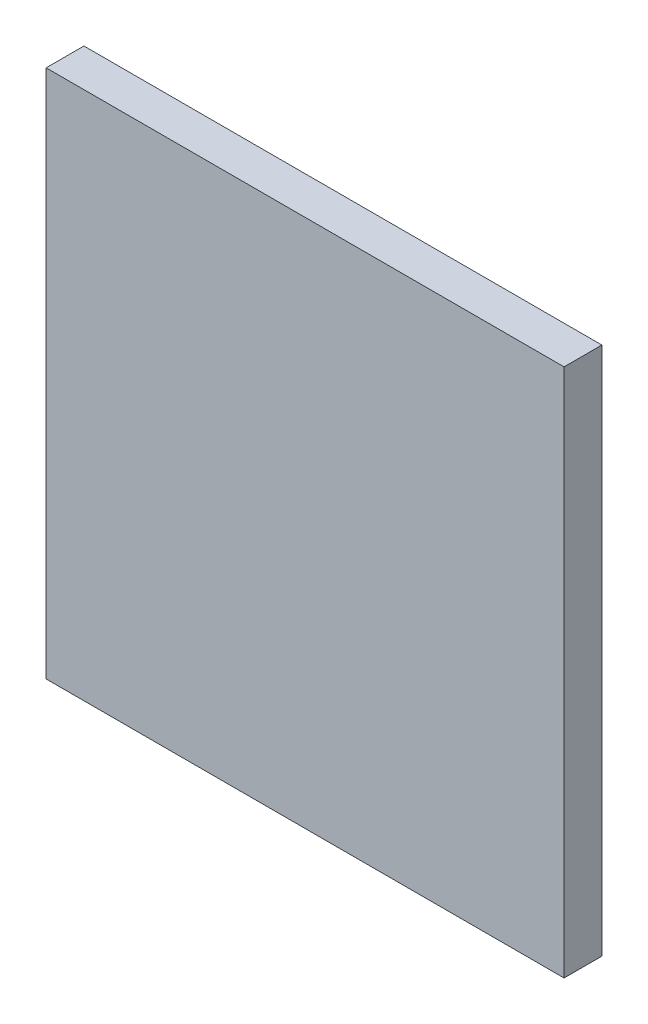
ISO-10303-21;
HEADER;
FILE_DESCRIPTION(('STEP AP214'),'2;1');
FILE_NAME('part.step','',(''),(''),'','','');
FILE_SCHEMA(('AUTOMOTIVE_DESIGN { 1 0 10303 214 1 1 1 1 }'));
ENDSEC;
DATA;
#1=APPLICATION_CONTEXT('core data for automotive mechanical design processes');
#2=APPLICATION_PROTOCOL_DEFINITION('international standard','automotive_design',2000,#1);
#3=PRODUCT_CONTEXT('',#1,'mechanical');
#4=PRODUCT('Part','Part','',(#3));
#5=PRODUCT_RELATED_PRODUCT_CATEGORY('part','',(#4));
#6=PRODUCT_DEFINITION_FORMATION('','',#4);
#7=PRODUCT_DEFINITION_CONTEXT('part definition',#1,'design');
#8=PRODUCT_DEFINITION('design','',#6,#7);
#9=PRODUCT_DEFINITION_SHAPE('','',#8);
#10=(LENGTH_UNIT() NAMED_UNIT(*) SI_UNIT(.MILLI.,.METRE.));
#11=(NAMED_UNIT(*) PLANE_ANGLE_UNIT() SI_UNIT($,.RADIAN.));
#12=(NAMED_UNIT(*) SI_UNIT($,.STERADIAN.) SOLID_ANGLE_UNIT());
#13=UNCERTAINTY_MEASURE_WITH_UNIT(LENGTH_MEASURE(1.E-05),#10,'distance_accuracy_value','');
#14=(GEOMETRIC_REPRESENTATION_CONTEXT(3) GLOBAL_UNCERTAINTY_ASSIGNED_CONTEXT((#13)) GLOBAL_UNIT_ASSIGNED_CONTEXT((#10,
#11,#12)) REPRESENTATION_CONTEXT('',''));
#15=CARTESIAN_POINT('',(0.,0.,0.));
#16=DIRECTION('',(0.,0.,1.));
#17=DIRECTION('',(1.,0.,0.));
#18=AXIS2_PLACEMENT_3D('',#15,#16,#17);
#19=CARTESIAN_POINT('',(-68.5,-70.,10.));
#20=DIRECTION('',(0.,1.,0.));
#21=DIRECTION('',(-1.,0.,0.));
#22=AXIS2_PLACEMENT_3D('',#19,#20,#21);
#23=PLANE('',#22);
#24=DIRECTION('',(1.,0.,0.));
#25=VECTOR('',#24,1.);
#26=CARTESIAN_POINT('',(-68.5,-70.,0.));
#27=LINE('',#26,#25);
#28=CARTESIAN_POINT('',(-68.5,-70.,0.));
#29=VERTEX_POINT('',#28);
#30=CARTESIAN_POINT('',(68.5,-70.,0.));
#31=VERTEX_POINT('',#30);
#32=EDGE_CURVE('E113',#29,#31,#27,.T.);
#33=ORIENTED_EDGE('',*,*,#32,.T.);
#34=DIRECTION('',(0.,0.,-1.));
#35=VECTOR('',#34,1.);
#36=CARTESIAN_POINT('',(68.5,-70.,10.));
#37=LINE('',#36,#35);
#38=CARTESIAN_POINT('',(68.5,-70.,10.));
#39=VERTEX_POINT('',#38);
#40=EDGE_CURVE('E11',#39,#31,#37,.T.);
#41=ORIENTED_EDGE('',*,*,#40,.F.);
#42=DIRECTION('',(1.,0.,0.));
#43=VECTOR('',#42,1.);
#44=CARTESIAN_POINT('',(-68.5,-70.,10.));
#45=LINE('',#44,#43);
#46=CARTESIAN_POINT('',(-68.5,-70.,10.));
#47=VERTEX_POINT('',#46);
#48=EDGE_CURVE('E97',#47,#39,#45,.T.);
#49=ORIENTED_EDGE('',*,*,#48,.F.);
#50=DIRECTION('',(0.,0.,-1.));
#51=VECTOR('',#50,1.);
#52=CARTESIAN_POINT('',(-68.5,-70.,10.));
#53=LINE('',#52,#51);
#54=EDGE_CURVE('E109',#47,#29,#53,.T.);
#55=ORIENTED_EDGE('',*,*,#54,.T.);
#56=EDGE_LOOP('',(#33,#41,#49,#55));
#57=FACE_BOUND('',#56,.T.);
#58=ADVANCED_FACE('F45',(#57),#23,.F.);
#59=CARTESIAN_POINT('',(68.5,70.,10.));
#60=DIRECTION('',(-1.,0.,0.));
#61=DIRECTION('',(0.,-1.,0.));
#62=AXIS2_PLACEMENT_3D('',#59,#60,#61);
#63=PLANE('',#62);
#64=DIRECTION('',(0.,1.,0.));
#65=VECTOR('',#64,1.);
#66=CARTESIAN_POINT('',(68.5,70.,0.));
#67=LINE('',#66,#65);
#68=CARTESIAN_POINT('',(68.5,70.,0.));
#69=VERTEX_POINT('',#68);
#70=EDGE_CURVE('E102',#31,#69,#67,.T.);
#71=ORIENTED_EDGE('',*,*,#70,.T.);
#72=DIRECTION('',(0.,0.,-1.));
#73=VECTOR('',#72,1.);
#74=CARTESIAN_POINT('',(68.5,70.,10.));
#75=LINE('',#74,#73);
#76=CARTESIAN_POINT('',(68.5,70.,10.));
#77=VERTEX_POINT('',#76);
#78=EDGE_CURVE('E54',#77,#69,#75,.T.);
#79=ORIENTED_EDGE('',*,*,#78,.F.);
#80=DIRECTION('',(0.,1.,0.));
#81=VECTOR('',#80,1.);
#82=CARTESIAN_POINT('',(68.5,70.,10.));
#83=LINE('',#82,#81);
#84=EDGE_CURVE('E92',#39,#77,#83,.T.);
#85=ORIENTED_EDGE('',*,*,#84,.F.);
#86=ORIENTED_EDGE('',*,*,#40,.T.);
#87=EDGE_LOOP('',(#71,#79,#85,#86));
#88=FACE_BOUND('',#87,.T.);
#89=ADVANCED_FACE('F101',(#88),#63,.F.);
#90=CARTESIAN_POINT('',(-68.5,70.,10.));
#91=DIRECTION('',(0.,-1.,0.));
#92=DIRECTION('',(0.,0.,-1.));
#93=AXIS2_PLACEMENT_3D('',#90,#91,#92);
#94=PLANE('',#93);
#95=DIRECTION('',(-1.,0.,0.));
#96=VECTOR('',#95,1.);
#97=CARTESIAN_POINT('',(-68.5,70.,0.));
#98=LINE('',#97,#96);
#99=CARTESIAN_POINT('',(-68.5,70.,0.));
#100=VERTEX_POINT('',#99);
#101=EDGE_CURVE('E79',#69,#100,#98,.T.);
#102=ORIENTED_EDGE('',*,*,#101,.T.);
#103=DIRECTION('',(0.,0.,-1.));
#104=VECTOR('',#103,1.);
#105=CARTESIAN_POINT('',(-68.5,70.,10.));
#106=LINE('',#105,#104);
#107=CARTESIAN_POINT('',(-68.5,70.,10.));
#108=VERTEX_POINT('',#107);
#109=EDGE_CURVE('E104',#108,#100,#106,.T.);
#110=ORIENTED_EDGE('',*,*,#109,.F.);
#111=DIRECTION('',(-1.,0.,0.));
#112=VECTOR('',#111,1.);
#113=CARTESIAN_POINT('',(-68.5,70.,10.));
#114=LINE('',#113,#112);
#115=EDGE_CURVE('E95',#77,#108,#114,.T.);
#116=ORIENTED_EDGE('',*,*,#115,.F.);
#117=ORIENTED_EDGE('',*,*,#78,.T.);
#118=EDGE_LOOP('',(#102,#110,#116,#117));
#119=FACE_BOUND('',#118,.T.);
#120=ADVANCED_FACE('F105',(#119),#94,.F.);
#121=CARTESIAN_POINT('',(-68.5,70.,10.));
#122=DIRECTION('',(1.,0.,0.));
#123=DIRECTION('',(0.,1.,0.));
#124=AXIS2_PLACEMENT_3D('',#121,#122,#123);
#125=PLANE('',#124);
#126=DIRECTION('',(0.,-1.,0.));
#127=VECTOR('',#126,1.);
#128=CARTESIAN_POINT('',(-68.5,70.,0.));
#129=LINE('',#128,#127);
#130=EDGE_CURVE('E85',#100,#29,#129,.T.);
#131=ORIENTED_EDGE('',*,*,#130,.T.);
#132=ORIENTED_EDGE('',*,*,#54,.F.);
#133=DIRECTION('',(0.,-1.,0.));
#134=VECTOR('',#133,1.);
#135=CARTESIAN_POINT('',(-68.5,70.,10.));
#136=LINE('',#135,#134);
#137=EDGE_CURVE('E62',#108,#47,#136,.T.);
#138=ORIENTED_EDGE('',*,*,#137,.F.);
#139=ORIENTED_EDGE('',*,*,#109,.T.);
#140=EDGE_LOOP('',(#131,#132,#138,#139));
#141=FACE_BOUND('',#140,.T.);
#142=ADVANCED_FACE('F126',(#141),#125,.F.);
#143=CARTESIAN_POINT('',(0.,0.,10.));
#144=DIRECTION('',(0.,0.,-1.));
#145=DIRECTION('',(-1.,0.,0.));
#146=AXIS2_PLACEMENT_3D('',#143,#144,#145);
#147=PLANE('',#146);
#148=ORIENTED_EDGE('',*,*,#48,.T.);
#149=ORIENTED_EDGE('',*,*,#84,.T.);
#150=ORIENTED_EDGE('',*,*,#115,.T.);
#151=ORIENTED_EDGE('',*,*,#137,.T.);
#152=EDGE_LOOP('',(#148,#149,#150,#151));
#153=FACE_BOUND('',#152,.T.);
#154=ADVANCED_FACE('F93',(#153),#147,.F.);
#155=CARTESIAN_POINT('',(0.,0.,0.));
#156=DIRECTION('',(0.,0.,-1.));
#157=DIRECTION('',(-1.,0.,0.));
#158=AXIS2_PLACEMENT_3D('',#155,#156,#157);
#159=PLANE('',#158);
#160=ORIENTED_EDGE('',*,*,#32,.F.);
#161=ORIENTED_EDGE('',*,*,#130,.F.);
#162=ORIENTED_EDGE('',*,*,#101,.F.);
#163=ORIENTED_EDGE('',*,*,#70,.F.);
#164=EDGE_LOOP('',(#160,#161,#162,#163));
#165=FACE_BOUND('',#164,.T.);
#166=ADVANCED_FACE('F129',(#165),#159,.T.);
#167=CLOSED_SHELL('',(#58,#89,#120,#142,#154,#166));
#168=MANIFOLD_SOLID_BREP('B2',#167);
#169=ADVANCED_BREP_SHAPE_REPRESENTATION('',(#18,#168),#14);
#170=SHAPE_DEFINITION_REPRESENTATION(#9,#169);
ENDSEC;
END-ISO-10303-21;
